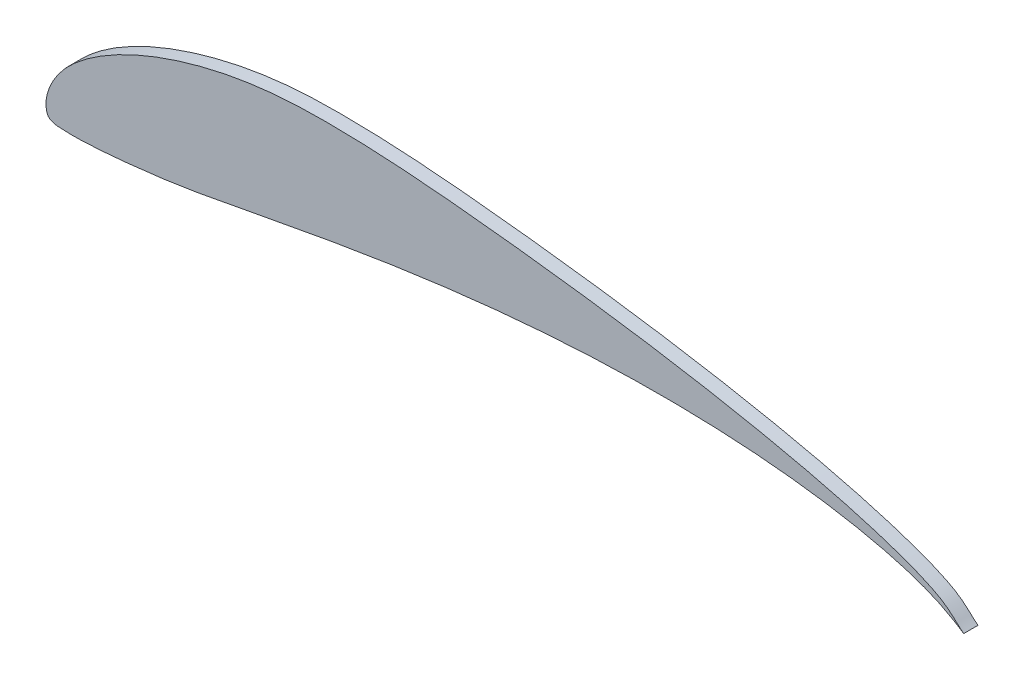
ISO-10303-21;
HEADER;
FILE_DESCRIPTION(('STEP AP214'),'2;1');
FILE_NAME('part.step','',(''),(''),'','','');
FILE_SCHEMA(('AUTOMOTIVE_DESIGN { 1 0 10303 214 1 1 1 1 }'));
ENDSEC;
DATA;
#1=APPLICATION_CONTEXT('core data for automotive mechanical design processes');
#2=APPLICATION_PROTOCOL_DEFINITION('international standard','automotive_design',2000,#1);
#3=PRODUCT_CONTEXT('',#1,'mechanical');
#4=PRODUCT('Part','Part','',(#3));
#5=PRODUCT_RELATED_PRODUCT_CATEGORY('part','',(#4));
#6=PRODUCT_DEFINITION_FORMATION('','',#4);
#7=PRODUCT_DEFINITION_CONTEXT('part definition',#1,'design');
#8=PRODUCT_DEFINITION('design','',#6,#7);
#9=PRODUCT_DEFINITION_SHAPE('','',#8);
#10=(LENGTH_UNIT() NAMED_UNIT(*) SI_UNIT(.MILLI.,.METRE.));
#11=(NAMED_UNIT(*) PLANE_ANGLE_UNIT() SI_UNIT($,.RADIAN.));
#12=(NAMED_UNIT(*) SI_UNIT($,.STERADIAN.) SOLID_ANGLE_UNIT());
#13=UNCERTAINTY_MEASURE_WITH_UNIT(LENGTH_MEASURE(1.E-05),#10,'distance_accuracy_value','');
#14=(GEOMETRIC_REPRESENTATION_CONTEXT(3) GLOBAL_UNCERTAINTY_ASSIGNED_CONTEXT((#13)) GLOBAL_UNIT_ASSIGNED_CONTEXT((#10,
#11,#12)) REPRESENTATION_CONTEXT('',''));
#15=CARTESIAN_POINT('',(0.,0.,0.));
#16=DIRECTION('',(0.,0.,1.));
#17=DIRECTION('',(1.,0.,0.));
#18=AXIS2_PLACEMENT_3D('',#15,#16,#17);
#19=CARTESIAN_POINT('',(85.9000013641913,11.3917660694825,421.000000000001));
#20=CARTESIAN_POINT('',(85.9209392706296,11.3537754263414,421.000000000001));
#21=CARTESIAN_POINT('',(85.971828674648,11.2841635754474,421.000000000001));
#22=CARTESIAN_POINT('',(86.0771868774301,11.2056818787259,421.000000000001));
#23=CARTESIAN_POINT('',(86.1990359004876,11.1467665257591,421.000000000001));
#24=CARTESIAN_POINT('',(86.372486012521,11.0904711863758,421.000000000001));
#25=CARTESIAN_POINT('',(86.5892644067118,11.0546553949065,421.000000000001));
#26=CARTESIAN_POINT('',(86.8498727202779,11.0406684113656,421.000000000001));
#27=CARTESIAN_POINT('',(87.1114843082795,11.029379947854,421.000000000001));
#28=CARTESIAN_POINT('',(87.4618379273304,11.018696706312,421.000000000001));
#29=CARTESIAN_POINT('',(87.9030398964882,11.0149765160878,421.000000000001));
#30=CARTESIAN_POINT('',(88.4214452447692,11.032761100328,421.000000000001));
#31=CARTESIAN_POINT('',(88.9570418502011,11.0609532599303,421.000000000001));
#32=CARTESIAN_POINT('',(89.4785020516705,11.0936346402233,421.000000000001));
#33=CARTESIAN_POINT('',(89.9962201012293,11.1314951286669,421.000000000001));
#34=CARTESIAN_POINT('',(90.5205902509294,11.1752246127211,421.000000000001));
#35=CARTESIAN_POINT('',(91.046363666826,11.2236534718276,421.000000000001));
#36=CARTESIAN_POINT('',(91.5682915149744,11.275612085428,421.000000000001));
#37=CARTESIAN_POINT('',(92.0891008364557,11.3309836740312,421.000000000001));
#38=CARTESIAN_POINT('',(92.6115186723512,11.3896514581462,421.000000000001));
#39=CARTESIAN_POINT('',(93.134076421247,11.4513791947748,421.000000000001));
#40=CARTESIAN_POINT('',(93.6553054817296,11.5159306409188,421.000000000001));
#41=CARTESIAN_POINT('',(94.3492781860143,11.606989386983,421.000000000001));
#42=CARTESIAN_POINT('',(95.2163181260587,11.7324666127955,421.000000000001));
#43=CARTESIAN_POINT('',(96.2527876583279,11.9027373478683,421.000000000001));
#44=CARTESIAN_POINT('',(97.2872917849363,12.0875782196362,421.000000000001));
#45=CARTESIAN_POINT('',(98.3194573247545,12.2821779693937,421.000000000001));
#46=CARTESIAN_POINT('',(99.3517858492489,12.4792075965766,421.000000000001));
#47=CARTESIAN_POINT('',(100.383293334784,12.6753765434765,421.000000000001));
#48=CARTESIAN_POINT('',(101.416620765851,12.870957199922,421.000000000001));
#49=CARTESIAN_POINT('',(102.790990043355,13.1286133996662,421.000000000001));
#50=CARTESIAN_POINT('',(104.516731475718,13.4447674939911,421.000000000001));
#51=CARTESIAN_POINT('',(106.584359871489,13.8054890491052,421.000000000001));
#52=CARTESIAN_POINT('',(108.659060101768,14.1455020955859,421.000000000001));
#53=CARTESIAN_POINT('',(110.735836681411,14.461324635724,421.000000000001));
#54=CARTESIAN_POINT('',(112.81741088136,14.7506445997651,421.000000000001));
#55=CARTESIAN_POINT('',(114.902297838651,15.0112919029587,421.000000000001));
#56=CARTESIAN_POINT('',(116.990967504759,15.2423295257135,421.000000000001));
#57=CARTESIAN_POINT('',(119.08283005645,15.4403815706954,421.000000000001));
#58=CARTESIAN_POINT('',(121.177893409165,15.6039048781858,421.000000000001));
#59=CARTESIAN_POINT('',(123.275155590087,15.7318576923524,421.000000000001));
#60=CARTESIAN_POINT('',(125.37490426614,15.8220457007299,421.000000000001));
#61=CARTESIAN_POINT('',(127.475108031299,15.871977805284,421.000000000001));
#62=CARTESIAN_POINT('',(129.577503032115,15.8788108645258,421.000000000001));
#63=CARTESIAN_POINT('',(131.326872063889,15.8465092859246,421.000000000001));
#64=CARTESIAN_POINT('',(132.728074944327,15.796132209664,421.000000000001));
#65=CARTESIAN_POINT('',(133.778028926319,15.7455979336055,421.000000000001));
#66=CARTESIAN_POINT('',(134.825232724128,15.6818286265106,421.000000000001));
#67=CARTESIAN_POINT('',(135.873975108834,15.6036923053217,421.000000000001));
#68=CARTESIAN_POINT('',(136.920052122761,15.5107616569721,421.000000000001));
#69=CARTESIAN_POINT('',(137.965405543836,15.4020495575392,421.000000000001));
#70=CARTESIAN_POINT('',(139.008432351066,15.2770400673804,421.000000000001));
#71=CARTESIAN_POINT('',(140.049714935938,15.1342827631839,421.000000000001));
#72=CARTESIAN_POINT('',(141.087359838699,14.9726276814677,421.000000000001));
#73=CARTESIAN_POINT('',(142.122847074824,14.7899512831947,421.000000000001));
#74=CARTESIAN_POINT('',(142.980390367461,14.6189586842139,421.000000000001));
#75=CARTESIAN_POINT('',(143.666139795134,14.469000632174,421.000000000001));
#76=CARTESIAN_POINT('',(144.178434104271,14.3498855440122,421.000000000001));
#77=CARTESIAN_POINT('',(144.686835493391,14.2240593440143,421.000000000001));
#78=CARTESIAN_POINT('',(145.195305674356,14.0902640287758,421.000000000001));
#79=CARTESIAN_POINT('',(145.699532333293,13.948122672113,421.000000000001));
#80=CARTESIAN_POINT('',(146.203176310942,13.7946793945526,421.000000000001));
#81=CARTESIAN_POINT('',(146.702277016088,13.6295183353596,421.000000000001));
#82=CARTESIAN_POINT('',(147.201983237104,13.4489153187213,421.000000000001));
#83=CARTESIAN_POINT('',(147.604647765019,13.2892993283614,421.000000000001));
#84=CARTESIAN_POINT('',(147.926356770924,13.152040649072,421.000000000001));
#85=CARTESIAN_POINT('',(148.160369639515,13.0467799766243,421.000000000001));
#86=CARTESIAN_POINT('',(148.395398935374,12.9348530341058,421.000000000001));
#87=CARTESIAN_POINT('',(148.630244117675,12.8159314323702,421.000000000001));
#88=CARTESIAN_POINT('',(148.86738616462,12.6882434278586,421.000000000001));
#89=CARTESIAN_POINT('',(149.110867202898,12.5489622073935,421.000000000001));
#90=CARTESIAN_POINT('',(149.339070983257,12.413732563654,421.000000000001));
#91=CARTESIAN_POINT('',(149.551173263109,12.2858090171291,421.000000000001));
#92=CARTESIAN_POINT('',(149.686588505493,12.2035315490367,421.000000000001));
#93=CARTESIAN_POINT('',(149.862971954032,12.0868201937051,421.000000000001));
#94=CARTESIAN_POINT('',(149.962604502508,12.0196842338479,421.000000000001));
#95=CARTESIAN_POINT('',(149.995346058724,11.9997227377421,421.000000000001));
#96=CARTESIAN_POINT('',(149.837507344402,12.1180679172762,421.000000000001));
#97=CARTESIAN_POINT('',(149.754181990783,12.1882286636164,421.000000000001));
#98=CARTESIAN_POINT('',(149.693367011929,12.2428442512605,421.000000000001));
#99=CARTESIAN_POINT('',(149.635889614588,12.2963166146144,421.000000000001));
#100=CARTESIAN_POINT('',(149.569252168529,12.3607612395035,421.000000000001));
#101=CARTESIAN_POINT('',(149.477138252015,12.4465280811969,421.000000000001));
#102=CARTESIAN_POINT('',(149.341120126815,12.5723831016221,421.000000000001));
#103=CARTESIAN_POINT('',(149.172722868962,12.7220186358304,421.000000000001));
#104=CARTESIAN_POINT('',(148.976858294804,12.8903910565682,421.000000000001));
#105=CARTESIAN_POINT('',(148.758644342565,13.0582033622371,421.000000000001));
#106=CARTESIAN_POINT('',(148.554580188706,13.2006346266517,421.000000000001));
#107=CARTESIAN_POINT('',(148.347939184145,13.3300000624662,421.000000000001));
#108=CARTESIAN_POINT('',(148.121994679799,13.4586148823346,421.000000000001));
#109=CARTESIAN_POINT('',(147.803264372876,13.626572326984,421.000000000001));
#110=CARTESIAN_POINT('',(147.387594109453,13.8251619907544,421.000000000001));
#111=CARTESIAN_POINT('',(146.910780177224,14.0301291965315,421.000000000001));
#112=CARTESIAN_POINT('',(146.432281223212,14.2248397203186,421.000000000001));
#113=CARTESIAN_POINT('',(145.936885991808,14.4132815378092,421.000000000001));
#114=CARTESIAN_POINT('',(145.436042977146,14.5934351213648,421.000000000001));
#115=CARTESIAN_POINT('',(144.94120067336,14.7632809433471,421.000000000001));
#116=CARTESIAN_POINT('',(144.445994692012,14.9258314893987,421.000000000001));
#117=CARTESIAN_POINT('',(143.944060644663,15.0840992451625,421.000000000001));
#118=CARTESIAN_POINT('',(143.271098684875,15.2885716734209,421.000000000001));
#119=CARTESIAN_POINT('',(142.432779287676,15.5303020116136,421.000000000001));
#120=CARTESIAN_POINT('',(141.417435795815,15.8063440265745,421.000000000001));
#121=CARTESIAN_POINT('',(140.400731814901,16.0680108798709,421.000000000001));
#122=CARTESIAN_POINT('',(139.379793372616,16.317891371136,421.000000000001));
#123=CARTESIAN_POINT('',(138.3569137775,16.5567308002225,421.000000000001));
#124=CARTESIAN_POINT('',(137.331522707149,16.7858681621667,421.000000000001));
#125=CARTESIAN_POINT('',(136.304164552502,17.0060836934382,421.000000000001));
#126=CARTESIAN_POINT('',(135.275379909603,17.2181387878215,421.000000000001));
#127=CARTESIAN_POINT('',(134.244463013149,17.4227601645371,421.000000000001));
#128=CARTESIAN_POINT('',(133.21329766037,17.619869424463,421.000000000001));
#129=CARTESIAN_POINT('',(131.833752958927,17.8734297614968,421.000000000001));
#130=CARTESIAN_POINT('',(130.110968043382,18.1737208606259,421.000000000001));
#131=CARTESIAN_POINT('',(128.035314880695,18.5101530892859,421.000000000001));
#132=CARTESIAN_POINT('',(125.95838868425,18.8232191214469,421.000000000001));
#133=CARTESIAN_POINT('',(123.877263238292,19.1165033824396,421.000000000001));
#134=CARTESIAN_POINT('',(121.794084148039,19.3897656183643,421.000000000001));
#135=CARTESIAN_POINT('',(119.70831887389,19.6447644408494,421.000000000001));
#136=CARTESIAN_POINT('',(117.620874384069,19.8848874793684,421.000000000001));
#137=CARTESIAN_POINT('',(115.531361141346,20.1060293562708,421.000000000001));
#138=CARTESIAN_POINT('',(113.439692810317,20.3074483499358,421.000000000001));
#139=CARTESIAN_POINT('',(111.345604723333,20.479518403543,421.000000000001));
#140=CARTESIAN_POINT('',(109.248559435396,20.616337662118,421.000000000001));
#141=CARTESIAN_POINT('',(107.148809199196,20.6990528843608,421.000000000001));
#142=CARTESIAN_POINT('',(105.047659635451,20.7266175014391,421.000000000001));
#143=CARTESIAN_POINT('',(102.945779443676,20.678213140315,421.000000000001));
#144=CARTESIAN_POINT('',(100.851761305862,20.4967457771399,421.000000000001));
#145=CARTESIAN_POINT('',(98.7707743251182,20.1853828466716,421.000000000001));
#146=CARTESIAN_POINT('',(96.7203912804468,19.7346707312934,421.000000000001));
#147=CARTESIAN_POINT('',(94.6951076080187,19.1456717412638,421.000000000001));
#148=CARTESIAN_POINT('',(93.059286177933,18.547541487712,421.000000000001));
#149=CARTESIAN_POINT('',(91.767093171459,17.9801924776765,421.000000000001));
#150=CARTESIAN_POINT('',(90.8211974382448,17.5135080798917,421.000000000001));
#151=CARTESIAN_POINT('',(89.9135676795159,17.0089008051878,421.000000000001));
#152=CARTESIAN_POINT('',(89.0336013047302,16.4485330776821,421.000000000001));
#153=CARTESIAN_POINT('',(88.1706957233456,15.814567321492,421.000000000001));
#154=CARTESIAN_POINT('',(87.3814475212343,15.1255534130582,421.000000000001));
#155=CARTESIAN_POINT('',(86.6880876023181,14.3426209704519,421.000000000001));
#156=CARTESIAN_POINT('',(86.2152524158288,13.5790563223724,421.000000000001));
#157=CARTESIAN_POINT('',(85.9477460596985,12.9485338378738,421.000000000001));
#158=CARTESIAN_POINT('',(85.8279587064918,12.5141647337883,421.000000000001));
#159=CARTESIAN_POINT('',(85.7819418753383,12.1709089389689,421.000000000001));
#160=CARTESIAN_POINT('',(85.7781456940666,11.9089003230877,421.000000000001));
#161=CARTESIAN_POINT('',(85.8088645576829,11.645667376898,421.000000000001));
#162=CARTESIAN_POINT('',(85.8581255513147,11.4677473557648,421.000000000001));
#163=CARTESIAN_POINT('',(85.9000013641913,11.3917660694825,421.000000000001));
#164=B_SPLINE_CURVE_WITH_KNOTS('',3,(#19,#20,#21,#22,#23,#24,#25,#26,#27,#28,#29,#30,#31,#32,
#33,#34,#35,#36,#37,#38,#39,#40,#41,#42,#43,#44,#45,#46,#47,#48,#49,#50,#51,#52,#53,#54,#55,#56,
#57,#58,#59,#60,#61,#62,#63,#64,#65,#66,#67,#68,#69,#70,#71,#72,#73,#74,#75,#76,#77,#78,#79,#80,
#81,#82,#83,#84,#85,#86,#87,#88,#89,#90,#91,#92,#93,#94,#95,#96,#97,#98,#99,#100,#101,#102,#103,
#104,#105,#106,#107,#108,#109,#110,#111,#112,#113,#114,#115,#116,#117,#118,#119,#120,#121,#122,
#123,#124,#125,#126,#127,#128,#129,#130,#131,#132,#133,#134,#135,#136,#137,#138,#139,#140,#141,
#142,#143,#144,#145,#146,#147,#148,#149,#150,#151,#152,#153,#154,#155,#156,#157,#158,#159,#160,
#161,#162,#163),.UNSPECIFIED.,.T.,.F.,(4,1,1,1,1,1,1,1,1,1,1,1,1,1,1,1,1,1,1,1,1,1,1,1,1,1,1,1,
1,1,1,1,1,1,1,1,1,1,1,1,1,1,1,1,1,1,1,1,1,1,1,1,1,1,1,1,1,1,1,1,1,1,1,1,1,1,1,1,1,1,1,1,1,1,1,1,
1,1,1,1,1,1,1,1,1,1,1,1,1,1,1,1,1,1,1,1,1,1,1,1,1,1,1,1,1,1,1,1,1,1,1,1,1,1,1,1,1,1,1,1,1,1,1,1,
1,1,1,1,1,1,1,1,1,1,1,1,1,1,1,1,1,1,4),(0.,0.0009765625,0.001953125,0.0029296875,0.00390625,
0.005859375,0.0078125,0.009765625,0.01171875,0.015625,0.01953125,0.0234375,0.02734375,0.03125,
0.03515625,0.0390625,0.04296875,0.046875,0.05078125,0.0546875,0.05859375,0.0625,0.0703125,
0.078125,0.0859375,0.09375,0.1015625,0.109375,0.1171875,0.125,0.140625,0.15625,0.171875,0.1875,
0.203125,0.21875,0.234375,0.25,0.265625,0.28125,0.296875,0.3125,0.328125,0.34375,0.3515625,
0.359375,0.3671875,0.375,0.3828125,0.390625,0.3984375,0.40625,0.4140625,0.421875,0.4296875,
0.43359375,0.4375,0.44140625,0.4453125,0.44921875,0.453125,0.45703125,0.4609375,0.46484375,
0.466796875,0.46875,0.470703125,0.47265625,0.474609375,0.4765625,0.478515625,0.48046875,
0.482421875,0.4833984375,0.48388671875,0.484375,0.4853515625,0.486328125,0.48681640625,
0.4873046875,0.48828125,0.4892578125,0.490234375,0.4921875,0.494140625,0.49609375,0.498046875,
0.5,0.501953125,0.50390625,0.5078125,0.51171875,0.515625,0.51953125,0.5234375,0.52734375,
0.53125,0.53515625,0.5390625,0.546875,0.5546875,0.5625,0.5703125,0.578125,0.5859375,0.59375,
0.6015625,0.609375,0.6171875,0.625,0.640625,0.65625,0.671875,0.6875,0.703125,0.71875,0.734375,
0.75,0.765625,0.78125,0.796875,0.8125,0.828125,0.84375,0.859375,0.875,0.890625,0.90625,0.921875,
0.9296875,0.9375,0.9453125,0.953125,0.9609375,0.96875,0.9765625,0.984375,0.98828125,0.9921875,
0.994140625,0.99609375,0.998046875,1.),.UNSPECIFIED.);
#165=DIRECTION('',(0.,0.,-1.));
#166=VECTOR('',#165,1.);
#167=SURFACE_OF_LINEAR_EXTRUSION('',#164,#166);
#168=CARTESIAN_POINT('',(85.9000013641913,11.3917660694825,421.000000000001));
#169=VERTEX_POINT('',#168);
#170=EDGE_CURVE('E10',#169,#169,#164,.T.);
#171=ORIENTED_EDGE('',*,*,#170,.F.);
#172=EDGE_LOOP('',(#171));
#173=FACE_BOUND('',#172,.T.);
#174=CARTESIAN_POINT('',(85.9000013641913,11.3917660694825,420.000000000001));
#175=CARTESIAN_POINT('',(85.9209392706296,11.3537754263414,420.000000000001));
#176=CARTESIAN_POINT('',(85.971828674648,11.2841635754474,420.000000000001));
#177=CARTESIAN_POINT('',(86.0771868774301,11.2056818787259,420.000000000001));
#178=CARTESIAN_POINT('',(86.1990359004876,11.1467665257591,420.000000000001));
#179=CARTESIAN_POINT('',(86.372486012521,11.0904711863758,420.000000000001));
#180=CARTESIAN_POINT('',(86.5892644067118,11.0546553949065,420.000000000001));
#181=CARTESIAN_POINT('',(86.8498727202779,11.0406684113656,420.000000000001));
#182=CARTESIAN_POINT('',(87.1114843082795,11.029379947854,420.000000000001));
#183=CARTESIAN_POINT('',(87.4618379273304,11.018696706312,420.000000000001));
#184=CARTESIAN_POINT('',(87.9030398964882,11.0149765160878,420.000000000001));
#185=CARTESIAN_POINT('',(88.4214452447692,11.032761100328,420.000000000001));
#186=CARTESIAN_POINT('',(88.9570418502011,11.0609532599303,420.000000000001));
#187=CARTESIAN_POINT('',(89.4785020516705,11.0936346402233,420.000000000001));
#188=CARTESIAN_POINT('',(89.9962201012293,11.1314951286669,420.000000000001));
#189=CARTESIAN_POINT('',(90.5205902509294,11.1752246127211,420.000000000001));
#190=CARTESIAN_POINT('',(91.046363666826,11.2236534718276,420.000000000001));
#191=CARTESIAN_POINT('',(91.5682915149744,11.275612085428,420.000000000001));
#192=CARTESIAN_POINT('',(92.0891008364557,11.3309836740312,420.000000000001));
#193=CARTESIAN_POINT('',(92.6115186723512,11.3896514581462,420.000000000001));
#194=CARTESIAN_POINT('',(93.134076421247,11.4513791947748,420.000000000001));
#195=CARTESIAN_POINT('',(93.6553054817296,11.5159306409188,420.000000000001));
#196=CARTESIAN_POINT('',(94.3492781860143,11.606989386983,420.000000000001));
#197=CARTESIAN_POINT('',(95.2163181260587,11.7324666127955,420.000000000001));
#198=CARTESIAN_POINT('',(96.2527876583279,11.9027373478683,420.000000000001));
#199=CARTESIAN_POINT('',(97.2872917849363,12.0875782196362,420.000000000001));
#200=CARTESIAN_POINT('',(98.3194573247545,12.2821779693937,420.000000000001));
#201=CARTESIAN_POINT('',(99.3517858492489,12.4792075965766,420.000000000001));
#202=CARTESIAN_POINT('',(100.383293334784,12.6753765434765,420.000000000001));
#203=CARTESIAN_POINT('',(101.416620765851,12.870957199922,420.000000000001));
#204=CARTESIAN_POINT('',(102.790990043355,13.1286133996662,420.000000000001));
#205=CARTESIAN_POINT('',(104.516731475718,13.4447674939911,420.000000000001));
#206=CARTESIAN_POINT('',(106.584359871489,13.8054890491052,420.000000000001));
#207=CARTESIAN_POINT('',(108.659060101768,14.1455020955859,420.000000000001));
#208=CARTESIAN_POINT('',(110.735836681411,14.461324635724,420.000000000001));
#209=CARTESIAN_POINT('',(112.81741088136,14.7506445997651,420.000000000001));
#210=CARTESIAN_POINT('',(114.902297838651,15.0112919029587,420.000000000001));
#211=CARTESIAN_POINT('',(116.990967504759,15.2423295257135,420.000000000001));
#212=CARTESIAN_POINT('',(119.08283005645,15.4403815706954,420.000000000001));
#213=CARTESIAN_POINT('',(121.177893409165,15.6039048781858,420.000000000001));
#214=CARTESIAN_POINT('',(123.275155590087,15.7318576923524,420.000000000001));
#215=CARTESIAN_POINT('',(125.37490426614,15.8220457007299,420.000000000001));
#216=CARTESIAN_POINT('',(127.475108031299,15.871977805284,420.000000000001));
#217=CARTESIAN_POINT('',(129.577503032115,15.8788108645258,420.000000000001));
#218=CARTESIAN_POINT('',(131.326872063889,15.8465092859246,420.000000000001));
#219=CARTESIAN_POINT('',(132.728074944327,15.796132209664,420.000000000001));
#220=CARTESIAN_POINT('',(133.778028926319,15.7455979336055,420.000000000001));
#221=CARTESIAN_POINT('',(134.825232724128,15.6818286265106,420.000000000001));
#222=CARTESIAN_POINT('',(135.873975108834,15.6036923053217,420.000000000001));
#223=CARTESIAN_POINT('',(136.920052122761,15.5107616569721,420.000000000001));
#224=CARTESIAN_POINT('',(137.965405543836,15.4020495575392,420.000000000001));
#225=CARTESIAN_POINT('',(139.008432351066,15.2770400673804,420.000000000001));
#226=CARTESIAN_POINT('',(140.049714935938,15.1342827631839,420.000000000001));
#227=CARTESIAN_POINT('',(141.087359838699,14.9726276814677,420.000000000001));
#228=CARTESIAN_POINT('',(142.122847074824,14.7899512831947,420.000000000001));
#229=CARTESIAN_POINT('',(142.980390367461,14.6189586842139,420.000000000001));
#230=CARTESIAN_POINT('',(143.666139795134,14.469000632174,420.000000000001));
#231=CARTESIAN_POINT('',(144.178434104271,14.3498855440122,420.000000000001));
#232=CARTESIAN_POINT('',(144.686835493391,14.2240593440143,420.000000000001));
#233=CARTESIAN_POINT('',(145.195305674356,14.0902640287758,420.000000000001));
#234=CARTESIAN_POINT('',(145.699532333293,13.948122672113,420.000000000001));
#235=CARTESIAN_POINT('',(146.203176310942,13.7946793945526,420.000000000001));
#236=CARTESIAN_POINT('',(146.702277016088,13.6295183353596,420.000000000001));
#237=CARTESIAN_POINT('',(147.201983237104,13.4489153187213,420.000000000001));
#238=CARTESIAN_POINT('',(147.604647765019,13.2892993283614,420.000000000001));
#239=CARTESIAN_POINT('',(147.926356770924,13.152040649072,420.000000000001));
#240=CARTESIAN_POINT('',(148.160369639515,13.0467799766243,420.000000000001));
#241=CARTESIAN_POINT('',(148.395398935374,12.9348530341058,420.000000000001));
#242=CARTESIAN_POINT('',(148.630244117675,12.8159314323702,420.000000000001));
#243=CARTESIAN_POINT('',(148.86738616462,12.6882434278586,420.000000000001));
#244=CARTESIAN_POINT('',(149.110867202898,12.5489622073935,420.000000000001));
#245=CARTESIAN_POINT('',(149.339070983257,12.413732563654,420.000000000001));
#246=CARTESIAN_POINT('',(149.551173263109,12.2858090171291,420.000000000001));
#247=CARTESIAN_POINT('',(149.686588505493,12.2035315490367,420.000000000001));
#248=CARTESIAN_POINT('',(149.862971954032,12.0868201937051,420.000000000001));
#249=CARTESIAN_POINT('',(149.962604502508,12.0196842338479,420.000000000001));
#250=CARTESIAN_POINT('',(149.995346058724,11.9997227377421,420.000000000001));
#251=CARTESIAN_POINT('',(149.837507344402,12.1180679172762,420.000000000001));
#252=CARTESIAN_POINT('',(149.754181990783,12.1882286636164,420.000000000001));
#253=CARTESIAN_POINT('',(149.693367011929,12.2428442512605,420.000000000001));
#254=CARTESIAN_POINT('',(149.635889614588,12.2963166146144,420.000000000001));
#255=CARTESIAN_POINT('',(149.569252168529,12.3607612395035,420.000000000001));
#256=CARTESIAN_POINT('',(149.477138252015,12.4465280811969,420.000000000001));
#257=CARTESIAN_POINT('',(149.341120126815,12.5723831016221,420.000000000001));
#258=CARTESIAN_POINT('',(149.172722868962,12.7220186358304,420.000000000001));
#259=CARTESIAN_POINT('',(148.976858294804,12.8903910565682,420.000000000001));
#260=CARTESIAN_POINT('',(148.758644342565,13.0582033622371,420.000000000001));
#261=CARTESIAN_POINT('',(148.554580188706,13.2006346266517,420.000000000001));
#262=CARTESIAN_POINT('',(148.347939184145,13.3300000624662,420.000000000001));
#263=CARTESIAN_POINT('',(148.121994679799,13.4586148823346,420.000000000001));
#264=CARTESIAN_POINT('',(147.803264372876,13.626572326984,420.000000000001));
#265=CARTESIAN_POINT('',(147.387594109453,13.8251619907544,420.000000000001));
#266=CARTESIAN_POINT('',(146.910780177224,14.0301291965315,420.000000000001));
#267=CARTESIAN_POINT('',(146.432281223212,14.2248397203186,420.000000000001));
#268=CARTESIAN_POINT('',(145.936885991808,14.4132815378092,420.000000000001));
#269=CARTESIAN_POINT('',(145.436042977146,14.5934351213648,420.000000000001));
#270=CARTESIAN_POINT('',(144.94120067336,14.7632809433471,420.000000000001));
#271=CARTESIAN_POINT('',(144.445994692012,14.9258314893987,420.000000000001));
#272=CARTESIAN_POINT('',(143.944060644663,15.0840992451625,420.000000000001));
#273=CARTESIAN_POINT('',(143.271098684875,15.2885716734209,420.000000000001));
#274=CARTESIAN_POINT('',(142.432779287676,15.5303020116136,420.000000000001));
#275=CARTESIAN_POINT('',(141.417435795815,15.8063440265745,420.000000000001));
#276=CARTESIAN_POINT('',(140.400731814901,16.0680108798709,420.000000000001));
#277=CARTESIAN_POINT('',(139.379793372616,16.317891371136,420.000000000001));
#278=CARTESIAN_POINT('',(138.3569137775,16.5567308002225,420.000000000001));
#279=CARTESIAN_POINT('',(137.331522707149,16.7858681621667,420.000000000001));
#280=CARTESIAN_POINT('',(136.304164552502,17.0060836934382,420.000000000001));
#281=CARTESIAN_POINT('',(135.275379909603,17.2181387878215,420.000000000001));
#282=CARTESIAN_POINT('',(134.244463013149,17.4227601645371,420.000000000001));
#283=CARTESIAN_POINT('',(133.21329766037,17.619869424463,420.000000000001));
#284=CARTESIAN_POINT('',(131.833752958927,17.8734297614968,420.000000000001));
#285=CARTESIAN_POINT('',(130.110968043382,18.1737208606259,420.000000000001));
#286=CARTESIAN_POINT('',(128.035314880695,18.5101530892859,420.000000000001));
#287=CARTESIAN_POINT('',(125.95838868425,18.8232191214469,420.000000000001));
#288=CARTESIAN_POINT('',(123.877263238292,19.1165033824396,420.000000000001));
#289=CARTESIAN_POINT('',(121.794084148039,19.3897656183643,420.000000000001));
#290=CARTESIAN_POINT('',(119.70831887389,19.6447644408494,420.000000000001));
#291=CARTESIAN_POINT('',(117.620874384069,19.8848874793684,420.000000000001));
#292=CARTESIAN_POINT('',(115.531361141346,20.1060293562708,420.000000000001));
#293=CARTESIAN_POINT('',(113.439692810317,20.3074483499358,420.000000000001));
#294=CARTESIAN_POINT('',(111.345604723333,20.479518403543,420.000000000001));
#295=CARTESIAN_POINT('',(109.248559435396,20.616337662118,420.000000000001));
#296=CARTESIAN_POINT('',(107.148809199196,20.6990528843608,420.000000000001));
#297=CARTESIAN_POINT('',(105.047659635451,20.7266175014391,420.000000000001));
#298=CARTESIAN_POINT('',(102.945779443676,20.678213140315,420.000000000001));
#299=CARTESIAN_POINT('',(100.851761305862,20.4967457771399,420.000000000001));
#300=CARTESIAN_POINT('',(98.7707743251182,20.1853828466716,420.000000000001));
#301=CARTESIAN_POINT('',(96.7203912804468,19.7346707312934,420.000000000001));
#302=CARTESIAN_POINT('',(94.6951076080187,19.1456717412638,420.000000000001));
#303=CARTESIAN_POINT('',(93.059286177933,18.547541487712,420.000000000001));
#304=CARTESIAN_POINT('',(91.767093171459,17.9801924776765,420.000000000001));
#305=CARTESIAN_POINT('',(90.8211974382448,17.5135080798917,420.000000000001));
#306=CARTESIAN_POINT('',(89.9135676795159,17.0089008051878,420.000000000001));
#307=CARTESIAN_POINT('',(89.0336013047302,16.4485330776821,420.000000000001));
#308=CARTESIAN_POINT('',(88.1706957233456,15.814567321492,420.000000000001));
#309=CARTESIAN_POINT('',(87.3814475212343,15.1255534130582,420.000000000001));
#310=CARTESIAN_POINT('',(86.6880876023181,14.3426209704519,420.000000000001));
#311=CARTESIAN_POINT('',(86.2152524158288,13.5790563223724,420.000000000001));
#312=CARTESIAN_POINT('',(85.9477460596985,12.9485338378738,420.000000000001));
#313=CARTESIAN_POINT('',(85.8279587064918,12.5141647337883,420.000000000001));
#314=CARTESIAN_POINT('',(85.7819418753383,12.1709089389689,420.000000000001));
#315=CARTESIAN_POINT('',(85.7781456940666,11.9089003230877,420.000000000001));
#316=CARTESIAN_POINT('',(85.8088645576829,11.645667376898,420.000000000001));
#317=CARTESIAN_POINT('',(85.8581255513147,11.4677473557648,420.000000000001));
#318=CARTESIAN_POINT('',(85.9000013641913,11.3917660694825,420.000000000001));
#319=B_SPLINE_CURVE_WITH_KNOTS('',3,(#174,#175,#176,#177,#178,#179,#180,#181,#182,#183,#184,
#185,#186,#187,#188,#189,#190,#191,#192,#193,#194,#195,#196,#197,#198,#199,#200,#201,#202,#203,
#204,#205,#206,#207,#208,#209,#210,#211,#212,#213,#214,#215,#216,#217,#218,#219,#220,#221,#222,
#223,#224,#225,#226,#227,#228,#229,#230,#231,#232,#233,#234,#235,#236,#237,#238,#239,#240,#241,
#242,#243,#244,#245,#246,#247,#248,#249,#250,#251,#252,#253,#254,#255,#256,#257,#258,#259,#260,
#261,#262,#263,#264,#265,#266,#267,#268,#269,#270,#271,#272,#273,#274,#275,#276,#277,#278,#279,
#280,#281,#282,#283,#284,#285,#286,#287,#288,#289,#290,#291,#292,#293,#294,#295,#296,#297,#298,
#299,#300,#301,#302,#303,#304,#305,#306,#307,#308,#309,#310,#311,#312,#313,#314,#315,#316,#317,
#318),.UNSPECIFIED.,.T.,.F.,(4,1,1,1,1,1,1,1,1,1,1,1,1,1,1,1,1,1,1,1,1,1,1,1,1,1,1,1,1,1,1,1,1,
1,1,1,1,1,1,1,1,1,1,1,1,1,1,1,1,1,1,1,1,1,1,1,1,1,1,1,1,1,1,1,1,1,1,1,1,1,1,1,1,1,1,1,1,1,1,1,1,
1,1,1,1,1,1,1,1,1,1,1,1,1,1,1,1,1,1,1,1,1,1,1,1,1,1,1,1,1,1,1,1,1,1,1,1,1,1,1,1,1,1,1,1,1,1,1,1,
1,1,1,1,1,1,1,1,1,1,1,1,1,4),(0.,0.0009765625,0.001953125,0.0029296875,0.00390625,0.005859375,
0.0078125,0.009765625,0.01171875,0.015625,0.01953125,0.0234375,0.02734375,0.03125,0.03515625,
0.0390625,0.04296875,0.046875,0.05078125,0.0546875,0.05859375,0.0625,0.0703125,0.078125,
0.0859375,0.09375,0.1015625,0.109375,0.1171875,0.125,0.140625,0.15625,0.171875,0.1875,0.203125,
0.21875,0.234375,0.25,0.265625,0.28125,0.296875,0.3125,0.328125,0.34375,0.3515625,0.359375,
0.3671875,0.375,0.3828125,0.390625,0.3984375,0.40625,0.4140625,0.421875,0.4296875,0.43359375,
0.4375,0.44140625,0.4453125,0.44921875,0.453125,0.45703125,0.4609375,0.46484375,0.466796875,
0.46875,0.470703125,0.47265625,0.474609375,0.4765625,0.478515625,0.48046875,0.482421875,
0.4833984375,0.48388671875,0.484375,0.4853515625,0.486328125,0.48681640625,0.4873046875,
0.48828125,0.4892578125,0.490234375,0.4921875,0.494140625,0.49609375,0.498046875,0.5,
0.501953125,0.50390625,0.5078125,0.51171875,0.515625,0.51953125,0.5234375,0.52734375,0.53125,
0.53515625,0.5390625,0.546875,0.5546875,0.5625,0.5703125,0.578125,0.5859375,0.59375,0.6015625,
0.609375,0.6171875,0.625,0.640625,0.65625,0.671875,0.6875,0.703125,0.71875,0.734375,0.75,
0.765625,0.78125,0.796875,0.8125,0.828125,0.84375,0.859375,0.875,0.890625,0.90625,0.921875,
0.9296875,0.9375,0.9453125,0.953125,0.9609375,0.96875,0.9765625,0.984375,0.98828125,0.9921875,
0.994140625,0.99609375,0.998046875,1.),.UNSPECIFIED.);
#320=CARTESIAN_POINT('',(85.9000013641913,11.3917660694825,420.000000000001));
#321=VERTEX_POINT('',#320);
#322=EDGE_CURVE('E43',#321,#321,#319,.T.);
#323=ORIENTED_EDGE('',*,*,#322,.T.);
#324=EDGE_LOOP('',(#323));
#325=FACE_BOUND('',#324,.T.);
#326=ADVANCED_FACE('F39',(#173,#325),#167,.F.);
#327=CARTESIAN_POINT('',(148.344721934181,13.3298749598085,421.000000000001));
#328=DIRECTION('',(0.,0.,-1.));
#329=DIRECTION('',(-1.,0.,0.));
#330=AXIS2_PLACEMENT_3D('',#327,#328,#329);
#331=PLANE('',#330);
#332=ORIENTED_EDGE('',*,*,#170,.T.);
#333=EDGE_LOOP('',(#332));
#334=FACE_BOUND('',#333,.T.);
#335=ADVANCED_FACE('F62',(#334),#331,.F.);
#336=CARTESIAN_POINT('',(148.344721934181,13.3298749598085,420.000000000001));
#337=DIRECTION('',(0.,0.,-1.));
#338=DIRECTION('',(-1.,0.,0.));
#339=AXIS2_PLACEMENT_3D('',#336,#337,#338);
#340=PLANE('',#339);
#341=ORIENTED_EDGE('',*,*,#322,.F.);
#342=EDGE_LOOP('',(#341));
#343=FACE_BOUND('',#342,.T.);
#344=ADVANCED_FACE('F60',(#343),#340,.T.);
#345=CLOSED_SHELL('',(#326,#335,#344));
#346=MANIFOLD_SOLID_BREP('B2',#345);
#347=ADVANCED_BREP_SHAPE_REPRESENTATION('',(#18,#346),#14);
#348=SHAPE_DEFINITION_REPRESENTATION(#9,#347);
ENDSEC;
END-ISO-10303-21;
